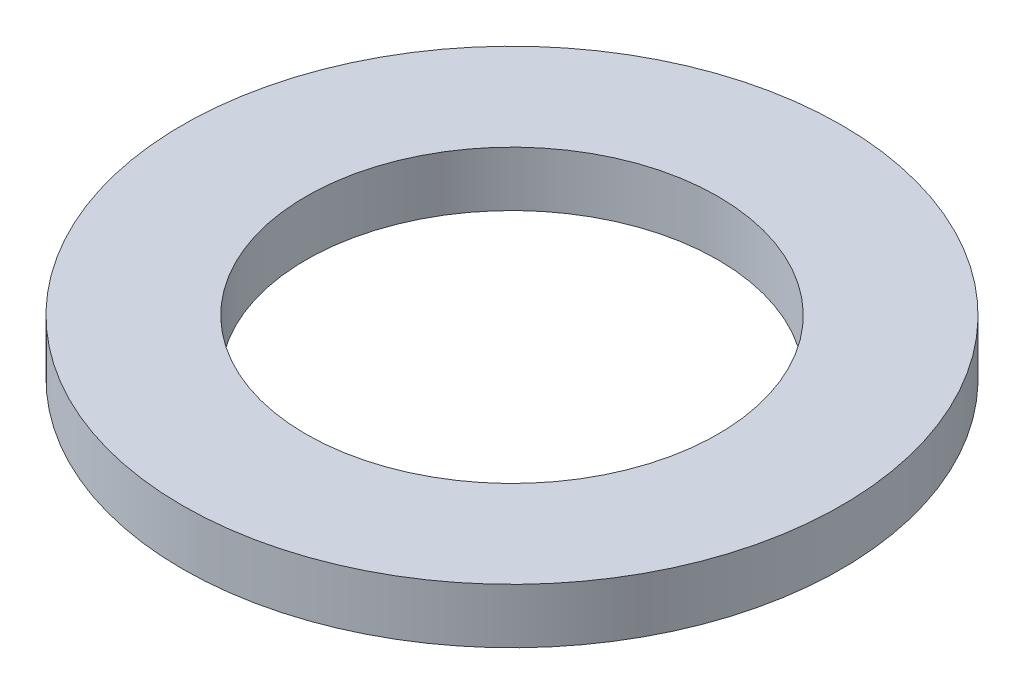
ISO-10303-21;
HEADER;
FILE_DESCRIPTION(('STEP AP214'),'2;1');
FILE_NAME('part.step','',(''),(''),'','','');
FILE_SCHEMA(('AUTOMOTIVE_DESIGN { 1 0 10303 214 1 1 1 1 }'));
ENDSEC;
DATA;
#1=APPLICATION_CONTEXT('core data for automotive mechanical design processes');
#2=APPLICATION_PROTOCOL_DEFINITION('international standard','automotive_design',2000,#1);
#3=PRODUCT_CONTEXT('',#1,'mechanical');
#4=PRODUCT('Part','Part','',(#3));
#5=PRODUCT_RELATED_PRODUCT_CATEGORY('part','',(#4));
#6=PRODUCT_DEFINITION_FORMATION('','',#4);
#7=PRODUCT_DEFINITION_CONTEXT('part definition',#1,'design');
#8=PRODUCT_DEFINITION('design','',#6,#7);
#9=PRODUCT_DEFINITION_SHAPE('','',#8);
#10=(LENGTH_UNIT() NAMED_UNIT(*) SI_UNIT(.MILLI.,.METRE.));
#11=(NAMED_UNIT(*) PLANE_ANGLE_UNIT() SI_UNIT($,.RADIAN.));
#12=(NAMED_UNIT(*) SI_UNIT($,.STERADIAN.) SOLID_ANGLE_UNIT());
#13=UNCERTAINTY_MEASURE_WITH_UNIT(LENGTH_MEASURE(1.E-05),#10,'distance_accuracy_value','');
#14=(GEOMETRIC_REPRESENTATION_CONTEXT(3) GLOBAL_UNCERTAINTY_ASSIGNED_CONTEXT((#13)) GLOBAL_UNIT_ASSIGNED_CONTEXT((#10,
#11,#12)) REPRESENTATION_CONTEXT('',''));
#15=CARTESIAN_POINT('',(0.,0.,0.));
#16=DIRECTION('',(0.,0.,1.));
#17=DIRECTION('',(1.,0.,0.));
#18=AXIS2_PLACEMENT_3D('',#15,#16,#17);
#19=CARTESIAN_POINT('',(0.,1.,0.));
#20=DIRECTION('',(0.,-1.,0.));
#21=DIRECTION('',(0.,0.,-1.));
#22=AXIS2_PLACEMENT_3D('',#19,#20,#21);
#23=CYLINDRICAL_SURFACE('',#22,6.);
#24=CARTESIAN_POINT('',(0.,1.,0.));
#25=DIRECTION('',(0.,1.,0.));
#26=DIRECTION('',(0.,0.,1.));
#27=AXIS2_PLACEMENT_3D('',#24,#25,#26);
#28=CIRCLE('',#27,6.);
#29=CARTESIAN_POINT('',(0.,1.,6.));
#30=VERTEX_POINT('',#29);
#31=EDGE_CURVE('E12',#30,#30,#28,.T.);
#32=ORIENTED_EDGE('',*,*,#31,.F.);
#33=EDGE_LOOP('',(#32));
#34=FACE_BOUND('',#33,.T.);
#35=CARTESIAN_POINT('',(0.,0.,0.));
#36=DIRECTION('',(0.,1.,0.));
#37=DIRECTION('',(0.,0.,1.));
#38=AXIS2_PLACEMENT_3D('',#35,#36,#37);
#39=CIRCLE('',#38,6.);
#40=CARTESIAN_POINT('',(0.,0.,6.));
#41=VERTEX_POINT('',#40);
#42=EDGE_CURVE('E48',#41,#41,#39,.T.);
#43=ORIENTED_EDGE('',*,*,#42,.T.);
#44=EDGE_LOOP('',(#43));
#45=FACE_BOUND('',#44,.T.);
#46=ADVANCED_FACE('F45',(#34,#45),#23,.T.);
#47=CARTESIAN_POINT('',(0.,1.,0.));
#48=DIRECTION('',(0.,1.,0.));
#49=DIRECTION('',(0.,0.,1.));
#50=AXIS2_PLACEMENT_3D('',#47,#48,#49);
#51=PLANE('',#50);
#52=CARTESIAN_POINT('',(0.,1.,0.));
#53=DIRECTION('',(0.,1.,0.));
#54=DIRECTION('',(0.,0.,1.));
#55=AXIS2_PLACEMENT_3D('',#52,#53,#54);
#56=CIRCLE('',#55,3.75);
#57=CARTESIAN_POINT('',(0.,1.,3.75));
#58=VERTEX_POINT('',#57);
#59=EDGE_CURVE('E59',#58,#58,#56,.T.);
#60=ORIENTED_EDGE('',*,*,#59,.F.);
#61=EDGE_LOOP('',(#60));
#62=FACE_BOUND('',#61,.T.);
#63=ORIENTED_EDGE('',*,*,#31,.T.);
#64=EDGE_LOOP('',(#63));
#65=FACE_BOUND('',#64,.T.);
#66=ADVANCED_FACE('F66',(#62,#65),#51,.T.);
#67=CARTESIAN_POINT('',(0.,0.,0.));
#68=DIRECTION('',(0.,1.,0.));
#69=DIRECTION('',(0.,0.,1.));
#70=AXIS2_PLACEMENT_3D('',#67,#68,#69);
#71=PLANE('',#70);
#72=CARTESIAN_POINT('',(0.,0.,0.));
#73=DIRECTION('',(0.,1.,0.));
#74=DIRECTION('',(0.,0.,1.));
#75=AXIS2_PLACEMENT_3D('',#72,#73,#74);
#76=CIRCLE('',#75,3.75);
#77=CARTESIAN_POINT('',(0.,0.,3.75));
#78=VERTEX_POINT('',#77);
#79=EDGE_CURVE('E55',#78,#78,#76,.F.);
#80=ORIENTED_EDGE('',*,*,#79,.F.);
#81=EDGE_LOOP('',(#80));
#82=FACE_BOUND('',#81,.T.);
#83=ORIENTED_EDGE('',*,*,#42,.F.);
#84=EDGE_LOOP('',(#83));
#85=FACE_BOUND('',#84,.T.);
#86=ADVANCED_FACE('F68',(#82,#85),#71,.F.);
#87=CARTESIAN_POINT('',(0.,-0.000999999999999916,0.));
#88=DIRECTION('',(0.,1.,0.));
#89=DIRECTION('',(0.,0.,1.));
#90=AXIS2_PLACEMENT_3D('',#87,#88,#89);
#91=CYLINDRICAL_SURFACE('',#90,3.75);
#92=ORIENTED_EDGE('',*,*,#59,.T.);
#93=EDGE_LOOP('',(#92));
#94=FACE_BOUND('',#93,.T.);
#95=ORIENTED_EDGE('',*,*,#79,.T.);
#96=EDGE_LOOP('',(#95));
#97=FACE_BOUND('',#96,.T.);
#98=ADVANCED_FACE('F63',(#94,#97),#91,.F.);
#99=CLOSED_SHELL('',(#46,#66,#86,#98));
#100=MANIFOLD_SOLID_BREP('B2',#99);
#101=ADVANCED_BREP_SHAPE_REPRESENTATION('',(#18,#100),#14);
#102=SHAPE_DEFINITION_REPRESENTATION(#9,#101);
ENDSEC;
END-ISO-10303-21;
